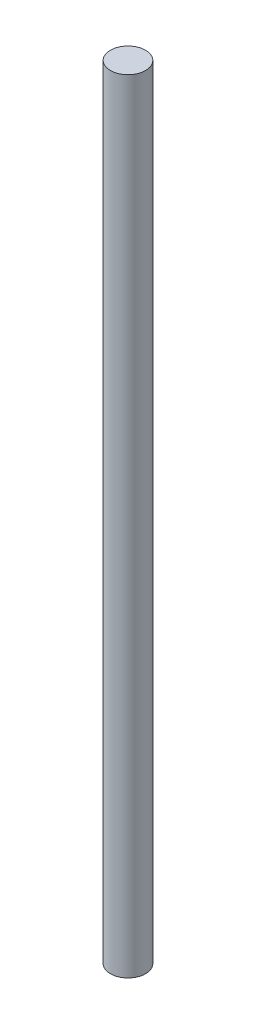
ISO-10303-21;
HEADER;
FILE_DESCRIPTION(('STEP AP214'),'2;1');
FILE_NAME('part.step','',(''),(''),'','','');
FILE_SCHEMA(('AUTOMOTIVE_DESIGN { 1 0 10303 214 1 1 1 1 }'));
ENDSEC;
DATA;
#1=APPLICATION_CONTEXT('core data for automotive mechanical design processes');
#2=APPLICATION_PROTOCOL_DEFINITION('international standard','automotive_design',2000,#1);
#3=PRODUCT_CONTEXT('',#1,'mechanical');
#4=PRODUCT('Part','Part','',(#3));
#5=PRODUCT_RELATED_PRODUCT_CATEGORY('part','',(#4));
#6=PRODUCT_DEFINITION_FORMATION('','',#4);
#7=PRODUCT_DEFINITION_CONTEXT('part definition',#1,'design');
#8=PRODUCT_DEFINITION('design','',#6,#7);
#9=PRODUCT_DEFINITION_SHAPE('','',#8);
#10=(LENGTH_UNIT() NAMED_UNIT(*) SI_UNIT(.MILLI.,.METRE.));
#11=(NAMED_UNIT(*) PLANE_ANGLE_UNIT() SI_UNIT($,.RADIAN.));
#12=(NAMED_UNIT(*) SI_UNIT($,.STERADIAN.) SOLID_ANGLE_UNIT());
#13=UNCERTAINTY_MEASURE_WITH_UNIT(LENGTH_MEASURE(1.E-05),#10,'distance_accuracy_value','');
#14=(GEOMETRIC_REPRESENTATION_CONTEXT(3) GLOBAL_UNCERTAINTY_ASSIGNED_CONTEXT((#13)) GLOBAL_UNIT_ASSIGNED_CONTEXT((#10,
#11,#12)) REPRESENTATION_CONTEXT('',''));
#15=CARTESIAN_POINT('',(0.,0.,0.));
#16=DIRECTION('',(0.,0.,1.));
#17=DIRECTION('',(1.,0.,0.));
#18=AXIS2_PLACEMENT_3D('',#15,#16,#17);
#19=CARTESIAN_POINT('',(0.,142.,0.));
#20=DIRECTION('',(0.,-1.,0.));
#21=DIRECTION('',(0.,0.,-1.));
#22=AXIS2_PLACEMENT_3D('',#19,#20,#21);
#23=CYLINDRICAL_SURFACE('',#22,3.19);
#24=CARTESIAN_POINT('',(0.,142.,0.));
#25=DIRECTION('',(0.,1.,0.));
#26=DIRECTION('',(0.,0.,1.));
#27=AXIS2_PLACEMENT_3D('',#24,#25,#26);
#28=CIRCLE('',#27,3.19);
#29=CARTESIAN_POINT('',(0.,142.,3.19));
#30=VERTEX_POINT('',#29);
#31=EDGE_CURVE('E10',#30,#30,#28,.T.);
#32=ORIENTED_EDGE('',*,*,#31,.F.);
#33=EDGE_LOOP('',(#32));
#34=FACE_BOUND('',#33,.T.);
#35=CARTESIAN_POINT('',(0.,0.,0.));
#36=DIRECTION('',(0.,1.,0.));
#37=DIRECTION('',(0.,0.,1.));
#38=AXIS2_PLACEMENT_3D('',#35,#36,#37);
#39=CIRCLE('',#38,3.19);
#40=CARTESIAN_POINT('',(0.,0.,3.19));
#41=VERTEX_POINT('',#40);
#42=EDGE_CURVE('E38',#41,#41,#39,.T.);
#43=ORIENTED_EDGE('',*,*,#42,.T.);
#44=EDGE_LOOP('',(#43));
#45=FACE_BOUND('',#44,.T.);
#46=ADVANCED_FACE('F35',(#34,#45),#23,.T.);
#47=CARTESIAN_POINT('',(0.,142.,0.));
#48=DIRECTION('',(0.,1.,0.));
#49=DIRECTION('',(0.,0.,1.));
#50=AXIS2_PLACEMENT_3D('',#47,#48,#49);
#51=PLANE('',#50);
#52=ORIENTED_EDGE('',*,*,#31,.T.);
#53=EDGE_LOOP('',(#52));
#54=FACE_BOUND('',#53,.T.);
#55=ADVANCED_FACE('F50',(#54),#51,.T.);
#56=CARTESIAN_POINT('',(0.,0.,0.));
#57=DIRECTION('',(0.,1.,0.));
#58=DIRECTION('',(0.,0.,1.));
#59=AXIS2_PLACEMENT_3D('',#56,#57,#58);
#60=PLANE('',#59);
#61=ORIENTED_EDGE('',*,*,#42,.F.);
#62=EDGE_LOOP('',(#61));
#63=FACE_BOUND('',#62,.T.);
#64=ADVANCED_FACE('F48',(#63),#60,.F.);
#65=CLOSED_SHELL('',(#46,#55,#64));
#66=MANIFOLD_SOLID_BREP('B2',#65);
#67=ADVANCED_BREP_SHAPE_REPRESENTATION('',(#18,#66),#14);
#68=SHAPE_DEFINITION_REPRESENTATION(#9,#67);
ENDSEC;
END-ISO-10303-21;
